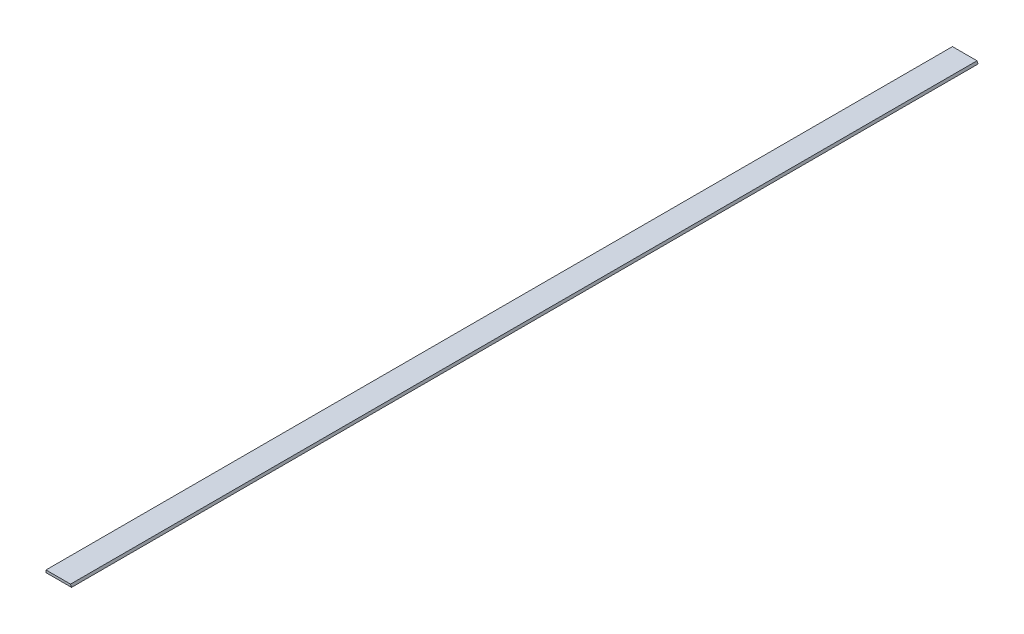
ISO-10303-21;
HEADER;
FILE_DESCRIPTION(('STEP AP214'),'2;1');
FILE_NAME('part.step','',(''),(''),'','','');
FILE_SCHEMA(('AUTOMOTIVE_DESIGN { 1 0 10303 214 1 1 1 1 }'));
ENDSEC;
DATA;
#1=APPLICATION_CONTEXT('core data for automotive mechanical design processes');
#2=APPLICATION_PROTOCOL_DEFINITION('international standard','automotive_design',2000,#1);
#3=PRODUCT_CONTEXT('',#1,'mechanical');
#4=PRODUCT('Part','Part','',(#3));
#5=PRODUCT_RELATED_PRODUCT_CATEGORY('part','',(#4));
#6=PRODUCT_DEFINITION_FORMATION('','',#4);
#7=PRODUCT_DEFINITION_CONTEXT('part definition',#1,'design');
#8=PRODUCT_DEFINITION('design','',#6,#7);
#9=PRODUCT_DEFINITION_SHAPE('','',#8);
#10=(LENGTH_UNIT() NAMED_UNIT(*) SI_UNIT(.MILLI.,.METRE.));
#11=(NAMED_UNIT(*) PLANE_ANGLE_UNIT() SI_UNIT($,.RADIAN.));
#12=(NAMED_UNIT(*) SI_UNIT($,.STERADIAN.) SOLID_ANGLE_UNIT());
#13=UNCERTAINTY_MEASURE_WITH_UNIT(LENGTH_MEASURE(1.E-05),#10,'distance_accuracy_value','');
#14=(GEOMETRIC_REPRESENTATION_CONTEXT(3) GLOBAL_UNCERTAINTY_ASSIGNED_CONTEXT((#13)) GLOBAL_UNIT_ASSIGNED_CONTEXT((#10,
#11,#12)) REPRESENTATION_CONTEXT('',''));
#15=CARTESIAN_POINT('',(0.,0.,0.));
#16=DIRECTION('',(0.,0.,1.));
#17=DIRECTION('',(1.,0.,0.));
#18=AXIS2_PLACEMENT_3D('',#15,#16,#17);
#19=CARTESIAN_POINT('',(25.4,0.,901.7));
#20=DIRECTION('',(0.,1.,0.));
#21=DIRECTION('',(-1.,0.,0.));
#22=AXIS2_PLACEMENT_3D('',#19,#20,#21);
#23=PLANE('',#22);
#24=DIRECTION('',(1.,0.,0.));
#25=VECTOR('',#24,1.);
#26=CARTESIAN_POINT('',(25.4,0.,0.));
#27=LINE('',#26,#25);
#28=CARTESIAN_POINT('',(0.,0.,0.));
#29=VERTEX_POINT('',#28);
#30=CARTESIAN_POINT('',(25.4,0.,0.));
#31=VERTEX_POINT('',#30);
#32=EDGE_CURVE('E98',#29,#31,#27,.T.);
#33=ORIENTED_EDGE('',*,*,#32,.T.);
#34=DIRECTION('',(0.,0.,-1.));
#35=VECTOR('',#34,1.);
#36=CARTESIAN_POINT('',(25.4,0.,901.7));
#37=LINE('',#36,#35);
#38=CARTESIAN_POINT('',(25.4,0.,901.7));
#39=VERTEX_POINT('',#38);
#40=EDGE_CURVE('E11',#39,#31,#37,.T.);
#41=ORIENTED_EDGE('',*,*,#40,.F.);
#42=DIRECTION('',(1.,0.,0.));
#43=VECTOR('',#42,1.);
#44=CARTESIAN_POINT('',(25.4,0.,901.7));
#45=LINE('',#44,#43);
#46=CARTESIAN_POINT('',(0.,0.,901.7));
#47=VERTEX_POINT('',#46);
#48=EDGE_CURVE('E86',#47,#39,#45,.T.);
#49=ORIENTED_EDGE('',*,*,#48,.F.);
#50=DIRECTION('',(0.,0.,-1.));
#51=VECTOR('',#50,1.);
#52=CARTESIAN_POINT('',(0.,0.,901.7));
#53=LINE('',#52,#51);
#54=EDGE_CURVE('E94',#47,#29,#53,.T.);
#55=ORIENTED_EDGE('',*,*,#54,.T.);
#56=EDGE_LOOP('',(#33,#41,#49,#55));
#57=FACE_BOUND('',#56,.T.);
#58=ADVANCED_FACE('F35',(#57),#23,.F.);
#59=CARTESIAN_POINT('',(24.4215447229623,2.3622,901.7));
#60=DIRECTION('',(-0.923879532511285,-0.382683432365095,0.));
#61=DIRECTION('',(0.382683432365095,-0.923879532511285,0.));
#62=AXIS2_PLACEMENT_3D('',#59,#60,#61);
#63=PLANE('',#62);
#64=DIRECTION('',(-0.382683432365095,0.923879532511285,0.));
#65=VECTOR('',#64,1.);
#66=CARTESIAN_POINT('',(24.4215447229623,2.3622,0.));
#67=LINE('',#66,#65);
#68=CARTESIAN_POINT('',(24.4215447229623,2.3622,0.));
#69=VERTEX_POINT('',#68);
#70=EDGE_CURVE('E90',#31,#69,#67,.T.);
#71=ORIENTED_EDGE('',*,*,#70,.T.);
#72=DIRECTION('',(0.,0.,-1.));
#73=VECTOR('',#72,1.);
#74=CARTESIAN_POINT('',(24.4215447229623,2.3622,901.7));
#75=LINE('',#74,#73);
#76=CARTESIAN_POINT('',(24.4215447229623,2.3622,901.7));
#77=VERTEX_POINT('',#76);
#78=EDGE_CURVE('E43',#77,#69,#75,.T.);
#79=ORIENTED_EDGE('',*,*,#78,.F.);
#80=DIRECTION('',(-0.382683432365095,0.923879532511285,0.));
#81=VECTOR('',#80,1.);
#82=CARTESIAN_POINT('',(24.4215447229623,2.3622,901.7));
#83=LINE('',#82,#81);
#84=EDGE_CURVE('E81',#39,#77,#83,.T.);
#85=ORIENTED_EDGE('',*,*,#84,.F.);
#86=ORIENTED_EDGE('',*,*,#40,.T.);
#87=EDGE_LOOP('',(#71,#79,#85,#86));
#88=FACE_BOUND('',#87,.T.);
#89=ADVANCED_FACE('F89',(#88),#63,.F.);
#90=CARTESIAN_POINT('',(0.,2.3622,901.7));
#91=DIRECTION('',(0.,-1.,0.));
#92=DIRECTION('',(0.,0.,-1.));
#93=AXIS2_PLACEMENT_3D('',#90,#91,#92);
#94=PLANE('',#93);
#95=DIRECTION('',(-1.,0.,0.));
#96=VECTOR('',#95,1.);
#97=CARTESIAN_POINT('',(0.,2.3622,0.));
#98=LINE('',#97,#96);
#99=CARTESIAN_POINT('',(0.,2.3622,0.));
#100=VERTEX_POINT('',#99);
#101=EDGE_CURVE('E68',#69,#100,#98,.T.);
#102=ORIENTED_EDGE('',*,*,#101,.T.);
#103=DIRECTION('',(0.,0.,-1.));
#104=VECTOR('',#103,1.);
#105=CARTESIAN_POINT('',(0.,2.3622,901.7));
#106=LINE('',#105,#104);
#107=CARTESIAN_POINT('',(0.,2.3622,901.7));
#108=VERTEX_POINT('',#107);
#109=EDGE_CURVE('E91',#108,#100,#106,.T.);
#110=ORIENTED_EDGE('',*,*,#109,.F.);
#111=DIRECTION('',(-1.,0.,0.));
#112=VECTOR('',#111,1.);
#113=CARTESIAN_POINT('',(0.,2.3622,901.7));
#114=LINE('',#113,#112);
#115=EDGE_CURVE('E84',#77,#108,#114,.T.);
#116=ORIENTED_EDGE('',*,*,#115,.F.);
#117=ORIENTED_EDGE('',*,*,#78,.T.);
#118=EDGE_LOOP('',(#102,#110,#116,#117));
#119=FACE_BOUND('',#118,.T.);
#120=ADVANCED_FACE('F92',(#119),#94,.F.);
#121=CARTESIAN_POINT('',(0.,0.,901.7));
#122=DIRECTION('',(1.,0.,0.));
#123=DIRECTION('',(0.,0.,-1.));
#124=AXIS2_PLACEMENT_3D('',#121,#122,#123);
#125=PLANE('',#124);
#126=DIRECTION('',(0.,-1.,0.));
#127=VECTOR('',#126,1.);
#128=CARTESIAN_POINT('',(0.,0.,0.));
#129=LINE('',#128,#127);
#130=EDGE_CURVE('E74',#100,#29,#129,.T.);
#131=ORIENTED_EDGE('',*,*,#130,.T.);
#132=ORIENTED_EDGE('',*,*,#54,.F.);
#133=DIRECTION('',(0.,-1.,0.));
#134=VECTOR('',#133,1.);
#135=CARTESIAN_POINT('',(0.,0.,901.7));
#136=LINE('',#135,#134);
#137=EDGE_CURVE('E51',#108,#47,#136,.T.);
#138=ORIENTED_EDGE('',*,*,#137,.F.);
#139=ORIENTED_EDGE('',*,*,#109,.T.);
#140=EDGE_LOOP('',(#131,#132,#138,#139));
#141=FACE_BOUND('',#140,.T.);
#142=ADVANCED_FACE('F105',(#141),#125,.F.);
#143=CARTESIAN_POINT('',(0.,0.,901.7));
#144=DIRECTION('',(0.,0.,-1.));
#145=DIRECTION('',(-1.,0.,0.));
#146=AXIS2_PLACEMENT_3D('',#143,#144,#145);
#147=PLANE('',#146);
#148=ORIENTED_EDGE('',*,*,#48,.T.);
#149=ORIENTED_EDGE('',*,*,#84,.T.);
#150=ORIENTED_EDGE('',*,*,#115,.T.);
#151=ORIENTED_EDGE('',*,*,#137,.T.);
#152=EDGE_LOOP('',(#148,#149,#150,#151));
#153=FACE_BOUND('',#152,.T.);
#154=ADVANCED_FACE('F82',(#153),#147,.F.);
#155=CARTESIAN_POINT('',(0.,0.,0.));
#156=DIRECTION('',(0.,0.,-1.));
#157=DIRECTION('',(-1.,0.,0.));
#158=AXIS2_PLACEMENT_3D('',#155,#156,#157);
#159=PLANE('',#158);
#160=ORIENTED_EDGE('',*,*,#32,.F.);
#161=ORIENTED_EDGE('',*,*,#130,.F.);
#162=ORIENTED_EDGE('',*,*,#101,.F.);
#163=ORIENTED_EDGE('',*,*,#70,.F.);
#164=EDGE_LOOP('',(#160,#161,#162,#163));
#165=FACE_BOUND('',#164,.T.);
#166=ADVANCED_FACE('F108',(#165),#159,.T.);
#167=CLOSED_SHELL('',(#58,#89,#120,#142,#154,#166));
#168=MANIFOLD_SOLID_BREP('B2',#167);
#169=ADVANCED_BREP_SHAPE_REPRESENTATION('',(#18,#168),#14);
#170=SHAPE_DEFINITION_REPRESENTATION(#9,#169);
ENDSEC;
END-ISO-10303-21;
